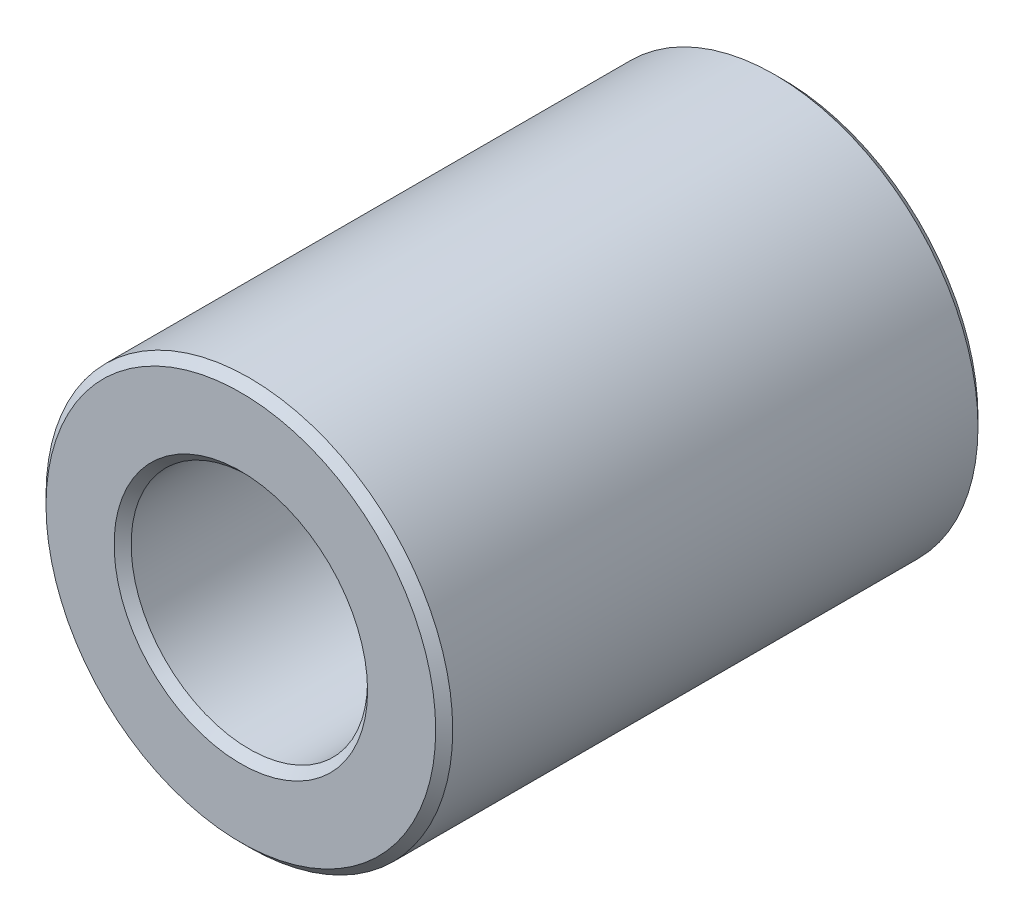
ISO-10303-21;
HEADER;
FILE_DESCRIPTION(('STEP AP214'),'2;1');
FILE_NAME('part.step','',(''),(''),'','','');
FILE_SCHEMA(('AUTOMOTIVE_DESIGN { 1 0 10303 214 1 1 1 1 }'));
ENDSEC;
DATA;
#1=APPLICATION_CONTEXT('core data for automotive mechanical design processes');
#2=APPLICATION_PROTOCOL_DEFINITION('international standard','automotive_design',2000,#1);
#3=PRODUCT_CONTEXT('',#1,'mechanical');
#4=PRODUCT('Part','Part','',(#3));
#5=PRODUCT_RELATED_PRODUCT_CATEGORY('part','',(#4));
#6=PRODUCT_DEFINITION_FORMATION('','',#4);
#7=PRODUCT_DEFINITION_CONTEXT('part definition',#1,'design');
#8=PRODUCT_DEFINITION('design','',#6,#7);
#9=PRODUCT_DEFINITION_SHAPE('','',#8);
#10=(LENGTH_UNIT() NAMED_UNIT(*) SI_UNIT(.MILLI.,.METRE.));
#11=(NAMED_UNIT(*) PLANE_ANGLE_UNIT() SI_UNIT($,.RADIAN.));
#12=(NAMED_UNIT(*) SI_UNIT($,.STERADIAN.) SOLID_ANGLE_UNIT());
#13=UNCERTAINTY_MEASURE_WITH_UNIT(LENGTH_MEASURE(1.E-05),#10,'distance_accuracy_value','');
#14=(GEOMETRIC_REPRESENTATION_CONTEXT(3) GLOBAL_UNCERTAINTY_ASSIGNED_CONTEXT((#13)) GLOBAL_UNIT_ASSIGNED_CONTEXT((#10,
#11,#12)) REPRESENTATION_CONTEXT('',''));
#15=CARTESIAN_POINT('',(0.,0.,0.));
#16=DIRECTION('',(0.,0.,1.));
#17=DIRECTION('',(1.,0.,0.));
#18=AXIS2_PLACEMENT_3D('',#15,#16,#17);
#19=CARTESIAN_POINT('',(0.,0.,-6.35));
#20=DIRECTION('',(0.,0.,1.));
#21=DIRECTION('',(1.,0.,0.));
#22=AXIS2_PLACEMENT_3D('',#19,#20,#21);
#23=CYLINDRICAL_SURFACE('',#22,4.7625);
#24=CARTESIAN_POINT('',(0.,0.,6.15061));
#25=DIRECTION('',(0.,0.,1.));
#26=DIRECTION('',(1.,0.,0.));
#27=AXIS2_PLACEMENT_3D('',#24,#25,#26);
#28=CIRCLE('',#27,4.7625);
#29=CARTESIAN_POINT('',(4.7625,0.,6.15061));
#30=VERTEX_POINT('',#29);
#31=EDGE_CURVE('E65',#30,#30,#28,.F.);
#32=ORIENTED_EDGE('',*,*,#31,.T.);
#33=EDGE_LOOP('',(#32));
#34=FACE_BOUND('',#33,.T.);
#35=CARTESIAN_POINT('',(0.,0.,-6.15061));
#36=DIRECTION('',(0.,0.,1.));
#37=DIRECTION('',(1.,0.,0.));
#38=AXIS2_PLACEMENT_3D('',#35,#36,#37);
#39=CIRCLE('',#38,4.7625);
#40=CARTESIAN_POINT('',(4.7625,0.,-6.15061));
#41=VERTEX_POINT('',#40);
#42=EDGE_CURVE('E69',#41,#41,#39,.T.);
#43=ORIENTED_EDGE('',*,*,#42,.T.);
#44=EDGE_LOOP('',(#43));
#45=FACE_BOUND('',#44,.T.);
#46=ADVANCED_FACE('F41',(#34,#45),#23,.T.);
#47=CARTESIAN_POINT('',(0.,0.,-6.35));
#48=DIRECTION('',(0.,0.,1.));
#49=DIRECTION('',(1.,0.,0.));
#50=AXIS2_PLACEMENT_3D('',#47,#48,#49);
#51=PLANE('',#50);
#52=CARTESIAN_POINT('',(0.,0.,-6.35));
#53=DIRECTION('',(0.,0.,1.));
#54=DIRECTION('',(1.,0.,0.));
#55=AXIS2_PLACEMENT_3D('',#52,#53,#54);
#56=CIRCLE('',#55,4.56311);
#57=CARTESIAN_POINT('',(4.56311,0.,-6.35));
#58=VERTEX_POINT('',#57);
#59=EDGE_CURVE('E54',#58,#58,#56,.F.);
#60=ORIENTED_EDGE('',*,*,#59,.T.);
#61=EDGE_LOOP('',(#60));
#62=FACE_BOUND('',#61,.T.);
#63=CARTESIAN_POINT('',(0.,0.,-6.35));
#64=DIRECTION('',(0.,0.,1.));
#65=DIRECTION('',(1.,0.,0.));
#66=AXIS2_PLACEMENT_3D('',#63,#64,#65);
#67=CIRCLE('',#66,2.96799);
#68=CARTESIAN_POINT('',(2.96799,0.,-6.35));
#69=VERTEX_POINT('',#68);
#70=EDGE_CURVE('E59',#69,#69,#67,.T.);
#71=ORIENTED_EDGE('',*,*,#70,.T.);
#72=EDGE_LOOP('',(#71));
#73=FACE_BOUND('',#72,.T.);
#74=ADVANCED_FACE('F97',(#62,#73),#51,.F.);
#75=CARTESIAN_POINT('',(0.,0.,-6.35));
#76=DIRECTION('',(0.,0.,1.));
#77=DIRECTION('',(1.,0.,0.));
#78=AXIS2_PLACEMENT_3D('',#75,#76,#77);
#79=CYLINDRICAL_SURFACE('',#78,2.7686);
#80=CARTESIAN_POINT('',(0.,0.,6.15061));
#81=DIRECTION('',(0.,0.,1.));
#82=DIRECTION('',(1.,0.,0.));
#83=AXIS2_PLACEMENT_3D('',#80,#81,#82);
#84=CIRCLE('',#83,2.7686);
#85=CARTESIAN_POINT('',(2.7686,0.,6.15061));
#86=VERTEX_POINT('',#85);
#87=EDGE_CURVE('E10',#86,#86,#84,.T.);
#88=ORIENTED_EDGE('',*,*,#87,.T.);
#89=EDGE_LOOP('',(#88));
#90=FACE_BOUND('',#89,.T.);
#91=CARTESIAN_POINT('',(0.,0.,-6.15061));
#92=DIRECTION('',(0.,0.,1.));
#93=DIRECTION('',(1.,0.,0.));
#94=AXIS2_PLACEMENT_3D('',#91,#92,#93);
#95=CIRCLE('',#94,2.7686);
#96=CARTESIAN_POINT('',(2.7686,0.,-6.15061));
#97=VERTEX_POINT('',#96);
#98=EDGE_CURVE('E49',#97,#97,#95,.F.);
#99=ORIENTED_EDGE('',*,*,#98,.T.);
#100=EDGE_LOOP('',(#99));
#101=FACE_BOUND('',#100,.T.);
#102=ADVANCED_FACE('F103',(#90,#101),#79,.F.);
#103=CARTESIAN_POINT('',(0.,0.,6.35));
#104=DIRECTION('',(0.,0.,1.));
#105=DIRECTION('',(1.,0.,0.));
#106=AXIS2_PLACEMENT_3D('',#103,#104,#105);
#107=PLANE('',#106);
#108=CARTESIAN_POINT('',(0.,0.,6.35));
#109=DIRECTION('',(0.,0.,1.));
#110=DIRECTION('',(1.,0.,0.));
#111=AXIS2_PLACEMENT_3D('',#108,#109,#110);
#112=CIRCLE('',#111,4.56311);
#113=CARTESIAN_POINT('',(4.56311,0.,6.35));
#114=VERTEX_POINT('',#113);
#115=EDGE_CURVE('E73',#114,#114,#112,.T.);
#116=ORIENTED_EDGE('',*,*,#115,.T.);
#117=EDGE_LOOP('',(#116));
#118=FACE_BOUND('',#117,.T.);
#119=CARTESIAN_POINT('',(0.,0.,6.35));
#120=DIRECTION('',(0.,0.,1.));
#121=DIRECTION('',(1.,0.,0.));
#122=AXIS2_PLACEMENT_3D('',#119,#120,#121);
#123=CIRCLE('',#122,2.96799);
#124=CARTESIAN_POINT('',(2.96799,0.,6.35));
#125=VERTEX_POINT('',#124);
#126=EDGE_CURVE('E77',#125,#125,#123,.F.);
#127=ORIENTED_EDGE('',*,*,#126,.T.);
#128=EDGE_LOOP('',(#127));
#129=FACE_BOUND('',#128,.T.);
#130=ADVANCED_FACE('F82',(#118,#129),#107,.T.);
#131=CARTESIAN_POINT('',(0.,0.,6.35));
#132=DIRECTION('',(0.,0.,-1.));
#133=DIRECTION('',(-1.,0.,0.));
#134=AXIS2_PLACEMENT_3D('',#131,#132,#133);
#135=CONICAL_SURFACE('',#134,4.56311,0.785398163397442);
#136=ORIENTED_EDGE('',*,*,#31,.F.);
#137=EDGE_LOOP('',(#136));
#138=FACE_BOUND('',#137,.T.);
#139=ORIENTED_EDGE('',*,*,#115,.F.);
#140=EDGE_LOOP('',(#139));
#141=FACE_BOUND('',#140,.T.);
#142=ADVANCED_FACE('F93',(#138,#141),#135,.T.);
#143=CARTESIAN_POINT('',(0.,0.,-6.15061));
#144=DIRECTION('',(0.,0.,1.));
#145=DIRECTION('',(1.,0.,0.));
#146=AXIS2_PLACEMENT_3D('',#143,#144,#145);
#147=CONICAL_SURFACE('',#146,4.7625,0.785398163397448);
#148=ORIENTED_EDGE('',*,*,#59,.F.);
#149=EDGE_LOOP('',(#148));
#150=FACE_BOUND('',#149,.T.);
#151=ORIENTED_EDGE('',*,*,#42,.F.);
#152=EDGE_LOOP('',(#151));
#153=FACE_BOUND('',#152,.T.);
#154=ADVANCED_FACE('F87',(#150,#153),#147,.T.);
#155=CARTESIAN_POINT('',(0.,0.,6.15061));
#156=DIRECTION('',(0.,0.,1.));
#157=DIRECTION('',(1.,0.,0.));
#158=AXIS2_PLACEMENT_3D('',#155,#156,#157);
#159=CONICAL_SURFACE('',#158,2.7686,0.785398163397447);
#160=ORIENTED_EDGE('',*,*,#126,.F.);
#161=EDGE_LOOP('',(#160));
#162=FACE_BOUND('',#161,.T.);
#163=ORIENTED_EDGE('',*,*,#87,.F.);
#164=EDGE_LOOP('',(#163));
#165=FACE_BOUND('',#164,.T.);
#166=ADVANCED_FACE('F84',(#162,#165),#159,.F.);
#167=CARTESIAN_POINT('',(0.,0.,-6.35));
#168=DIRECTION('',(0.,0.,-1.));
#169=DIRECTION('',(-1.,0.,0.));
#170=AXIS2_PLACEMENT_3D('',#167,#168,#169);
#171=CONICAL_SURFACE('',#170,2.96799,0.785398163397445);
#172=ORIENTED_EDGE('',*,*,#98,.F.);
#173=EDGE_LOOP('',(#172));
#174=FACE_BOUND('',#173,.T.);
#175=ORIENTED_EDGE('',*,*,#70,.F.);
#176=EDGE_LOOP('',(#175));
#177=FACE_BOUND('',#176,.T.);
#178=ADVANCED_FACE('F43',(#174,#177),#171,.F.);
#179=CLOSED_SHELL('',(#46,#74,#102,#130,#142,#154,#166,#178));
#180=MANIFOLD_SOLID_BREP('B2',#179);
#181=ADVANCED_BREP_SHAPE_REPRESENTATION('',(#18,#180),#14);
#182=SHAPE_DEFINITION_REPRESENTATION(#9,#181);
ENDSEC;
END-ISO-10303-21;
